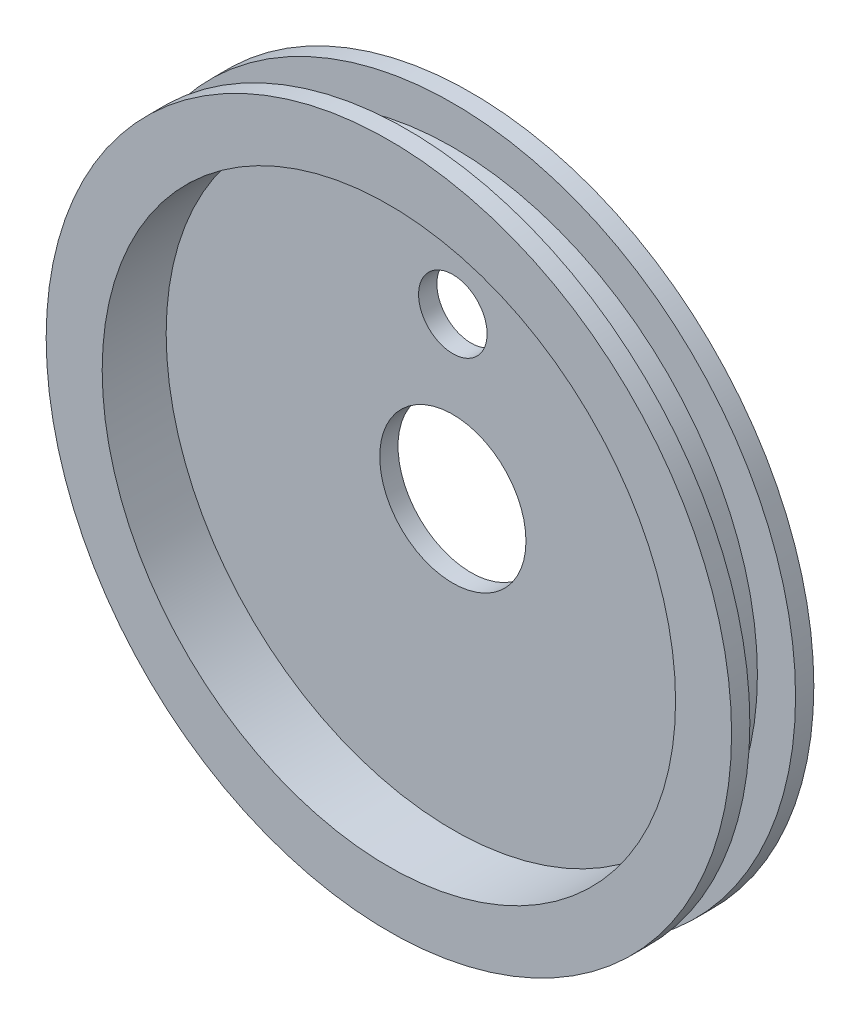
ISO-10303-21;
HEADER;
FILE_DESCRIPTION(('STEP AP214'),'2;1');
FILE_NAME('part.step','',(''),(''),'','','');
FILE_SCHEMA(('AUTOMOTIVE_DESIGN { 1 0 10303 214 1 1 1 1 }'));
ENDSEC;
DATA;
#1=APPLICATION_CONTEXT('core data for automotive mechanical design processes');
#2=APPLICATION_PROTOCOL_DEFINITION('international standard','automotive_design',2000,#1);
#3=PRODUCT_CONTEXT('',#1,'mechanical');
#4=PRODUCT('Part','Part','',(#3));
#5=PRODUCT_RELATED_PRODUCT_CATEGORY('part','',(#4));
#6=PRODUCT_DEFINITION_FORMATION('','',#4);
#7=PRODUCT_DEFINITION_CONTEXT('part definition',#1,'design');
#8=PRODUCT_DEFINITION('design','',#6,#7);
#9=PRODUCT_DEFINITION_SHAPE('','',#8);
#10=(LENGTH_UNIT() NAMED_UNIT(*) SI_UNIT(.MILLI.,.METRE.));
#11=(NAMED_UNIT(*) PLANE_ANGLE_UNIT() SI_UNIT($,.RADIAN.));
#12=(NAMED_UNIT(*) SI_UNIT($,.STERADIAN.) SOLID_ANGLE_UNIT());
#13=UNCERTAINTY_MEASURE_WITH_UNIT(LENGTH_MEASURE(1.E-05),#10,'distance_accuracy_value','');
#14=(GEOMETRIC_REPRESENTATION_CONTEXT(3) GLOBAL_UNCERTAINTY_ASSIGNED_CONTEXT((#13)) GLOBAL_UNIT_ASSIGNED_CONTEXT((#10,
#11,#12)) REPRESENTATION_CONTEXT('',''));
#15=CARTESIAN_POINT('',(0.,0.,0.));
#16=DIRECTION('',(0.,0.,1.));
#17=DIRECTION('',(1.,0.,0.));
#18=AXIS2_PLACEMENT_3D('',#15,#16,#17);
#19=CARTESIAN_POINT('',(0.,47.625,-2.54));
#20=DIRECTION('',(0.,0.,1.));
#21=DIRECTION('',(1.,0.,0.));
#22=AXIS2_PLACEMENT_3D('',#19,#20,#21);
#23=PLANE('',#22);
#24=CARTESIAN_POINT('',(0.,0.,-2.54));
#25=DIRECTION('',(0.,0.,1.));
#26=DIRECTION('',(1.,0.,0.));
#27=AXIS2_PLACEMENT_3D('',#24,#25,#26);
#28=CIRCLE('',#27,10.16);
#29=CARTESIAN_POINT('',(10.16,0.,-2.54));
#30=VERTEX_POINT('',#29);
#31=EDGE_CURVE('E73',#30,#30,#28,.T.);
#32=ORIENTED_EDGE('',*,*,#31,.T.);
#33=EDGE_LOOP('',(#32));
#34=FACE_BOUND('',#33,.T.);
#35=CARTESIAN_POINT('',(0.,22.225,-2.54));
#36=DIRECTION('',(0.,0.,1.));
#37=DIRECTION('',(1.,0.,0.));
#38=AXIS2_PLACEMENT_3D('',#35,#36,#37);
#39=CIRCLE('',#38,4.7625);
#40=CARTESIAN_POINT('',(-0.853024004277097,26.9104835714286,-2.54));
#41=VERTEX_POINT('',#40);
#42=CARTESIAN_POINT('',(0.853024004277097,26.9104835714286,-2.54));
#43=VERTEX_POINT('',#42);
#44=EDGE_CURVE('E67',#41,#43,#39,.T.);
#45=ORIENTED_EDGE('',*,*,#44,.T.);
#46=CARTESIAN_POINT('',(0.,0.,-2.54));
#47=DIRECTION('',(0.,0.,-1.));
#48=DIRECTION('',(-1.,0.,0.));
#49=AXIS2_PLACEMENT_3D('',#46,#47,#48);
#50=CIRCLE('',#49,26.924);
#51=EDGE_CURVE('E46',#43,#41,#50,.T.);
#52=ORIENTED_EDGE('',*,*,#51,.T.);
#53=EDGE_LOOP('',(#45,#52));
#54=FACE_BOUND('',#53,.T.);
#55=ADVANCED_FACE('F33',(#34,#54),#23,.F.);
#56=CARTESIAN_POINT('',(0.,0.,0.));
#57=DIRECTION('',(0.,0.,1.));
#58=DIRECTION('',(1.,0.,0.));
#59=AXIS2_PLACEMENT_3D('',#56,#57,#58);
#60=CYLINDRICAL_SURFACE('',#59,39.8398051528074);
#61=CARTESIAN_POINT('',(0.,0.,0.));
#62=DIRECTION('',(0.,0.,1.));
#63=DIRECTION('',(1.,0.,0.));
#64=AXIS2_PLACEMENT_3D('',#61,#62,#63);
#65=CIRCLE('',#64,39.8398051528074);
#66=CARTESIAN_POINT('',(39.8398051528074,0.,0.));
#67=VERTEX_POINT('',#66);
#68=EDGE_CURVE('E84',#67,#67,#65,.T.);
#69=ORIENTED_EDGE('',*,*,#68,.F.);
#70=EDGE_LOOP('',(#69));
#71=FACE_BOUND('',#70,.T.);
#72=CARTESIAN_POINT('',(0.,0.,8.89));
#73=DIRECTION('',(0.,0.,1.));
#74=DIRECTION('',(1.,0.,0.));
#75=AXIS2_PLACEMENT_3D('',#72,#73,#74);
#76=CIRCLE('',#75,39.8398051528074);
#77=CARTESIAN_POINT('',(39.8398051528074,0.,8.89));
#78=VERTEX_POINT('',#77);
#79=EDGE_CURVE('E81',#78,#78,#76,.T.);
#80=ORIENTED_EDGE('',*,*,#79,.T.);
#81=EDGE_LOOP('',(#80));
#82=FACE_BOUND('',#81,.T.);
#83=CARTESIAN_POINT('',(0.,39.8398051528074,2.98141861498659));
#84=CARTESIAN_POINT('',(0.0499288520424898,39.8398050189471,2.98142082707529));
#85=CARTESIAN_POINT('',(0.0998937489956119,39.8397102862242,2.98563895800753));
#86=CARTESIAN_POINT('',(0.198447026245543,39.8393414855794,3.00240712871577));
#87=CARTESIAN_POINT('',(0.247033683787857,39.8390672027133,3.01496715506395));
#88=CARTESIAN_POINT('',(0.341388460274037,39.838370368002,3.04806097311859));
#89=CARTESIAN_POINT('',(0.387157931086581,39.8379478879338,3.06859090523784));
#90=CARTESIAN_POINT('',(0.474587903429547,39.8370023321323,3.11703633356333));
#91=CARTESIAN_POINT('',(0.516249412892733,39.8364792811686,3.14495001186642));
#92=CARTESIAN_POINT('',(0.594306950466275,39.8353913070132,3.20738134347018));
#93=CARTESIAN_POINT('',(0.630701606195339,39.8348263729659,3.24190071259017));
#94=CARTESIAN_POINT('',(0.697180909828324,39.8337184015034,3.31656093253445));
#95=CARTESIAN_POINT('',(0.727265308001243,39.8331753649555,3.35670200573516));
#96=CARTESIAN_POINT('',(0.780270867007228,39.8321723913691,3.44146949289096));
#97=CARTESIAN_POINT('',(0.803191413596461,39.8317124614578,3.4860962910283));
#98=CARTESIAN_POINT('',(0.841214553407833,39.8309276371052,3.57856565421414));
#99=CARTESIAN_POINT('',(0.85631717099588,39.830602742243,3.62640820923966));
#100=CARTESIAN_POINT('',(0.87827336917194,39.8301246842132,3.72394258303009));
#101=CARTESIAN_POINT('',(0.885128326067495,39.8299714923932,3.77363409182833));
#102=CARTESIAN_POINT('',(0.890398847535254,39.8298540265871,3.87346277438261));
#103=CARTESIAN_POINT('',(0.888814437537807,39.8298897520317,3.92359994679525));
#104=CARTESIAN_POINT('',(0.877252387129153,39.8301460653447,4.02288740082374));
#105=CARTESIAN_POINT('',(0.867276240196033,39.8303666203189,4.07203785645211));
#106=CARTESIAN_POINT('',(0.83921620831718,39.8309676766993,4.16796620251455));
#107=CARTESIAN_POINT('',(0.821132309668231,39.8313481783758,4.21474408893849));
#108=CARTESIAN_POINT('',(0.777368400321464,39.8322262702664,4.30460420722662));
#109=CARTESIAN_POINT('',(0.75168770458807,39.8327238710389,4.34768610535565));
#110=CARTESIAN_POINT('',(0.693459705980447,39.8337800526231,4.42892762643978));
#111=CARTESIAN_POINT('',(0.6609123956652,39.8343386335008,4.46708724406077));
#112=CARTESIAN_POINT('',(0.589866611361192,39.8354539501939,4.53740970106475));
#113=CARTESIAN_POINT('',(0.551366840483524,39.8360106855802,4.56957123024065));
#114=CARTESIAN_POINT('',(0.469513592431183,39.8370594297202,4.62697446700608));
#115=CARTESIAN_POINT('',(0.426160114544587,39.8375514384645,4.65221617358064));
#116=CARTESIAN_POINT('',(0.33582939915632,39.8384152669079,4.69506308180457));
#117=CARTESIAN_POINT('',(0.288852142714982,39.8387870859789,4.71266824353838));
#118=CARTESIAN_POINT('',(0.1926077251012,39.8393686083555,4.73974147852577));
#119=CARTESIAN_POINT('',(0.143340567423051,39.8395783119087,4.74920956419576));
#120=CARTESIAN_POINT('',(0.0439262635908171,39.8398119316732,4.75973827716946));
#121=CARTESIAN_POINT('',(-0.00622069050895823,39.8398358879387,4.76080071704185));
#122=CARTESIAN_POINT('',(-0.10598107670898,39.8396954185272,4.75449270101634));
#123=CARTESIAN_POINT('',(-0.155594509140325,39.8395309929672,4.74712225035212));
#124=CARTESIAN_POINT('',(-0.252874442664679,39.8390323196941,4.72415917561094));
#125=CARTESIAN_POINT('',(-0.300541137808491,39.8386980889521,4.70856737320434));
#126=CARTESIAN_POINT('',(-0.392580446704433,39.8378974766485,4.66960502987248));
#127=CARTESIAN_POINT('',(-0.436953056980487,39.8374310949475,4.64623448073886));
#128=CARTESIAN_POINT('',(-0.521152952961519,39.836418638383,4.59237338380643));
#129=CARTESIAN_POINT('',(-0.560979457657947,39.8358725498627,4.56188161533409));
#130=CARTESIAN_POINT('',(-0.634948765826682,39.8347622796692,4.49464542773066));
#131=CARTESIAN_POINT('',(-0.669091560245824,39.8341980979671,4.45790099864037));
#132=CARTESIAN_POINT('',(-0.73073028314084,39.8331151318793,4.37919478060514));
#133=CARTESIAN_POINT('',(-0.758225041947966,39.8325963554925,4.33723207551008));
#134=CARTESIAN_POINT('',(-0.805779201329419,39.8316628150072,4.24928519266334));
#135=CARTESIAN_POINT('',(-0.82583861468679,39.83124805073,4.20330102182563));
#136=CARTESIAN_POINT('',(-0.857950628251854,39.8305693540948,4.10862095263577));
#137=CARTESIAN_POINT('',(-0.870003988785013,39.8303054074142,4.05992531226489));
#138=CARTESIAN_POINT('',(-0.885764242835529,39.8299580642524,3.96120090577609));
#139=CARTESIAN_POINT('',(-0.889471133686009,39.8298746678289,3.91117213923221));
#140=CARTESIAN_POINT('',(-0.8884331201314,39.8298978332203,3.81121341398135));
#141=CARTESIAN_POINT('',(-0.883690066495685,39.8300043534383,3.76128343603485));
#142=CARTESIAN_POINT('',(-0.865890593814175,39.8303952562232,3.6629286005792));
#143=CARTESIAN_POINT('',(-0.852834158171777,39.8306796391452,3.61450374607504));
#144=CARTESIAN_POINT('',(-0.81877866299651,39.8313942042507,3.52053271127797));
#145=CARTESIAN_POINT('',(-0.797779461625233,39.831824389038,3.47498658240904));
#146=CARTESIAN_POINT('',(-0.74843556664385,39.8327820403258,3.38806759557407));
#147=CARTESIAN_POINT('',(-0.720091148837359,39.8333095031734,3.34669458099388));
#148=CARTESIAN_POINT('',(-0.656857504723889,39.8344023433423,3.26928870045195));
#149=CARTESIAN_POINT('',(-0.621967541689803,39.8349677249268,3.23325643643091));
#150=CARTESIAN_POINT('',(-0.546623418074129,39.8360727704873,3.16755125330458));
#151=CARTESIAN_POINT('',(-0.506167879558315,39.8366124280498,3.1378799137159));
#152=CARTESIAN_POINT('',(-0.420829104914401,39.837605328039,3.08573597680793));
#153=CARTESIAN_POINT('',(-0.375943350858958,39.8380585208891,3.06326750443527));
#154=CARTESIAN_POINT('',(-0.283070622217011,39.8388264524819,3.02621131703086));
#155=CARTESIAN_POINT('',(-0.235087431837899,39.8391413566361,3.01161418206143));
#156=CARTESIAN_POINT('',(-0.155666606205625,39.8395128473673,2.99459327678612));
#157=CARTESIAN_POINT('',(-0.124744727626768,39.8396219878217,2.98965897243386));
#158=CARTESIAN_POINT('',(-0.062553282889765,39.8397681824721,2.98307094878893));
#159=CARTESIAN_POINT('',(-0.0312837167876895,39.8398052366796,2.98141722896722));
#160=CARTESIAN_POINT('',(0.,39.8398051528074,2.98141861498659));
#161=B_SPLINE_CURVE_WITH_KNOTS('',3,(#83,#84,#85,#86,#87,#88,#89,#90,#91,#92,#93,#94,#95,#96,
#97,#98,#99,#100,#101,#102,#103,#104,#105,#106,#107,#108,#109,#110,#111,#112,#113,#114,#115,
#116,#117,#118,#119,#120,#121,#122,#123,#124,#125,#126,#127,#128,#129,#130,#131,#132,#133,#134,
#135,#136,#137,#138,#139,#140,#141,#142,#143,#144,#145,#146,#147,#148,#149,#150,#151,#152,#153,
#154,#155,#156,#157,#158,#159,#160),.UNSPECIFIED.,.T.,.F.,(4,2,2,2,2,2,2,2,2,2,2,2,2,2,2,2,2,2,
2,2,2,2,2,2,2,2,2,2,2,2,2,2,2,2,2,2,2,2,4),(0.,0.149672368356552,0.29952424203869,
0.44930363728063,0.5990461905993,0.748827692270692,0.898615120487832,1.04841538827584,
1.19821518918299,1.34798998915824,1.49776433781724,1.64751203676172,1.79725998880136,
1.94702144837058,2.0967830702299,2.24657736741667,2.39637168657477,2.54616678868548,
2.69596166222266,2.84572423355444,2.99548671193976,3.14523422538055,3.29498189683977,
3.44475525594444,3.59452885360979,3.74432878359936,3.89412845604767,4.04391390016161,
4.19369939213523,4.34345208101524,4.49320506885827,4.64296073105041,4.79271077092086,
4.94247767587612,5.09228172731978,5.24217141610306,5.39188132566982,5.48566094499122,
5.57944054918929),.UNSPECIFIED.);
#162=CARTESIAN_POINT('',(0.,39.8398051528074,2.98141861498659));
#163=VERTEX_POINT('',#162);
#164=EDGE_CURVE('E103',#163,#163,#161,.T.);
#165=ORIENTED_EDGE('',*,*,#164,.F.);
#166=EDGE_LOOP('',(#165));
#167=FACE_BOUND('',#166,.T.);
#168=ADVANCED_FACE('F109',(#71,#82,#167),#60,.F.);
#169=CARTESIAN_POINT('',(0.,0.,0.));
#170=DIRECTION('',(0.,0.,1.));
#171=DIRECTION('',(1.,0.,0.));
#172=AXIS2_PLACEMENT_3D('',#169,#170,#171);
#173=CYLINDRICAL_SURFACE('',#172,42.32529);
#174=CARTESIAN_POINT('',(0.,0.,6.35));
#175=DIRECTION('',(0.,0.,1.));
#176=DIRECTION('',(1.,0.,0.));
#177=AXIS2_PLACEMENT_3D('',#174,#175,#176);
#178=CIRCLE('',#177,42.32529);
#179=CARTESIAN_POINT('',(42.32529,0.,6.35));
#180=VERTEX_POINT('',#179);
#181=EDGE_CURVE('E96',#180,#180,#178,.T.);
#182=ORIENTED_EDGE('',*,*,#181,.F.);
#183=EDGE_LOOP('',(#182));
#184=FACE_BOUND('',#183,.T.);
#185=CARTESIAN_POINT('',(0.,0.,0.));
#186=DIRECTION('',(0.,0.,1.));
#187=DIRECTION('',(1.,0.,0.));
#188=AXIS2_PLACEMENT_3D('',#185,#186,#187);
#189=CIRCLE('',#188,42.32529);
#190=CARTESIAN_POINT('',(42.32529,0.,0.));
#191=VERTEX_POINT('',#190);
#192=EDGE_CURVE('E93',#191,#191,#189,.T.);
#193=ORIENTED_EDGE('',*,*,#192,.T.);
#194=EDGE_LOOP('',(#193));
#195=FACE_BOUND('',#194,.T.);
#196=CARTESIAN_POINT('',(0.,42.32529,2.98141861498659));
#197=CARTESIAN_POINT('',(-0.0499296120777934,42.3252898739703,2.98142082733742));
#198=CARTESIAN_POINT('',(-0.0998952876539651,42.3252007015313,2.98563908618748));
#199=CARTESIAN_POINT('',(-0.198450152827213,42.3248535474286,3.00240779460558));
#200=CARTESIAN_POINT('',(-0.247037618841143,42.3245953633392,3.01496823589063));
#201=CARTESIAN_POINT('',(-0.341394016352993,42.3239394293395,3.04806322094483));
#202=CARTESIAN_POINT('',(-0.387164297702076,42.3235417468913,3.06859391077084));
#203=CARTESIAN_POINT('',(-0.474595730402443,42.3226516937417,3.1170411928185));
#204=CARTESIAN_POINT('',(-0.516257890896018,42.3221593463824,3.1449559649362));
#205=CARTESIAN_POINT('',(-0.594315745583253,42.3211352523972,3.2073892059897));
#206=CARTESIAN_POINT('',(-0.630710160805565,42.3206034962504,3.24190927393656));
#207=CARTESIAN_POINT('',(-0.697188808874741,42.3195606025159,3.31657084994335));
#208=CARTESIAN_POINT('',(-0.727272792204875,42.3190494657441,3.3567125801812));
#209=CARTESIAN_POINT('',(-0.780277018347561,42.318105424443,3.44148072512352));
#210=CARTESIAN_POINT('',(-0.803196732227812,42.317672525691,3.48610747063181));
#211=CARTESIAN_POINT('',(-0.841218270171466,42.3169338338777,3.57857644840945));
#212=CARTESIAN_POINT('',(-0.85632011761405,42.3166280404363,3.62641867106248));
#213=CARTESIAN_POINT('',(-0.878275141928297,42.3161780906474,3.72395308588133));
#214=CARTESIAN_POINT('',(-0.885129536462519,42.3160339104393,3.77364500383906));
#215=CARTESIAN_POINT('',(-0.890398825893437,42.3159233715167,3.87347438114387));
#216=CARTESIAN_POINT('',(-0.888813745055074,42.3159570122909,3.92361183920952));
#217=CARTESIAN_POINT('',(-0.877250133498243,42.3161982994669,4.02290080720812));
#218=CARTESIAN_POINT('',(-0.867272925576054,42.3164059184457,4.07205247127533));
#219=CARTESIAN_POINT('',(-0.83921031790074,42.3169717128389,4.16798305570311));
#220=CARTESIAN_POINT('',(-0.821124905029469,42.3173298884968,4.21476197222472));
#221=CARTESIAN_POINT('',(-0.777357753094501,42.3181564486638,4.30462338836936));
#222=CARTESIAN_POINT('',(-0.751675407276978,42.3186248419752,4.34770559238769));
#223=CARTESIAN_POINT('',(-0.693443884794253,42.3196190231392,4.42894737008021));
#224=CARTESIAN_POINT('',(-0.660894701852571,42.3201448110443,4.46710693925493));
#225=CARTESIAN_POINT('',(-0.589845966847594,42.3211946284692,4.53742795224619));
#226=CARTESIAN_POINT('',(-0.551345265688443,42.3217186576295,4.56958823509223));
#227=CARTESIAN_POINT('',(-0.469490457905188,42.3227057822773,4.62698881553404));
#228=CARTESIAN_POINT('',(-0.426136350578899,42.3231688777559,4.65222911212863));
#229=CARTESIAN_POINT('',(-0.335804779951831,42.3239819310574,4.69507309212989));
#230=CARTESIAN_POINT('',(-0.288827299955405,42.3243318883588,4.71267674034622));
#231=CARTESIAN_POINT('',(-0.192582809477149,42.3248792044991,4.73974697781159));
#232=CARTESIAN_POINT('',(-0.143315802102439,42.325076563545,4.74921357810308));
#233=CARTESIAN_POINT('',(-0.0439008732974561,42.3252964081861,4.75973957469376));
#234=CARTESIAN_POINT('',(0.00624687801857583,42.3253189271871,4.76080057700588));
#235=CARTESIAN_POINT('',(0.106008620796154,42.32518664153,4.75448944269879));
#236=CARTESIAN_POINT('',(0.155622612548418,42.3250318369686,4.747117310673));
#237=CARTESIAN_POINT('',(0.252903985208035,42.3245623756152,4.72415050702803));
#238=CARTESIAN_POINT('',(0.300571538025351,42.3242477329732,4.70855656326105));
#239=CARTESIAN_POINT('',(0.392612176578595,42.3234940601472,4.66958953733121));
#240=CARTESIAN_POINT('',(0.436985259282332,42.3230550298486,4.64621644800863));
#241=CARTESIAN_POINT('',(0.52118474880612,42.3221019761661,4.59235047575363));
#242=CARTESIAN_POINT('',(0.561010463538259,42.3215879413938,4.56185651120252));
#243=CARTESIAN_POINT('',(0.634977755365647,42.3205428595163,4.49461599506995));
#244=CARTESIAN_POINT('',(0.669119324178201,42.3200118123863,4.45786943437762));
#245=CARTESIAN_POINT('',(0.73075450252613,42.3189924800004,4.37915996367885));
#246=CARTESIAN_POINT('',(0.758247075560659,42.318504201419,4.33719624191965));
#247=CARTESIAN_POINT('',(0.805796739998628,42.3176255617166,4.24924783701514));
#248=CARTESIAN_POINT('',(0.825853843624142,42.3172352004346,4.20326316047944));
#249=CARTESIAN_POINT('',(0.857961414631366,42.3165964540058,4.1085821045371));
#250=CARTESIAN_POINT('',(0.870012556291809,42.3163480569026,4.05988595387093));
#251=CARTESIAN_POINT('',(0.885768330869535,42.3160212105151,3.96116097664618));
#252=CARTESIAN_POINT('',(0.889472959707888,42.3159427613137,3.91113214943633));
#253=CARTESIAN_POINT('',(0.888430451921636,42.3159646601508,3.81117243344274));
#254=CARTESIAN_POINT('',(0.883684956815074,42.3160649734629,3.7612415275231));
#255=CARTESIAN_POINT('',(0.865880268377808,42.3164330155629,3.66288523089004));
#256=CARTESIAN_POINT('',(0.852821058434744,42.3167007446852,3.61445984318513));
#257=CARTESIAN_POINT('',(0.818759713336494,42.3173734338617,3.5204881861531));
#258=CARTESIAN_POINT('',(0.7977574353478,42.3177783963836,3.47494196861686));
#259=CARTESIAN_POINT('',(0.748407157592086,42.3186798789506,3.3880233734676));
#260=CARTESIAN_POINT('',(0.720059435074458,42.31917639554,3.34665083840331));
#261=CARTESIAN_POINT('',(0.656819877990526,42.3202050866824,3.26924756776812));
#262=CARTESIAN_POINT('',(0.621927468687045,42.3207372643644,3.23321730183917));
#263=CARTESIAN_POINT('',(0.546578817932324,42.3217773922375,3.16751655224001));
#264=CARTESIAN_POINT('',(0.50612119831044,42.3222853363853,3.13784764857096));
#265=CARTESIAN_POINT('',(0.42077924015169,42.3232198597729,3.08570925818333));
#266=CARTESIAN_POINT('',(0.375892431442407,42.3236463932163,3.06324381887603));
#267=CARTESIAN_POINT('',(0.283018275295015,42.3243691242123,3.02619379543535));
#268=CARTESIAN_POINT('',(0.235034712539334,42.3246654775294,3.01159978809233));
#269=CARTESIAN_POINT('',(0.155622219190976,42.3250150169904,2.99458570932139));
#270=CARTESIAN_POINT('',(0.124709026194083,42.3251176898312,2.98965423601651));
#271=CARTESIAN_POINT('',(0.0625352718989247,42.3252552208021,2.98306999620126));
#272=CARTESIAN_POINT('',(0.0312747106502187,42.325290078942,2.98141722922314));
#273=CARTESIAN_POINT('',(0.,42.32529,2.98141861498659));
#274=B_SPLINE_CURVE_WITH_KNOTS('',3,(#196,#197,#198,#199,#200,#201,#202,#203,#204,#205,#206,
#207,#208,#209,#210,#211,#212,#213,#214,#215,#216,#217,#218,#219,#220,#221,#222,#223,#224,#225,
#226,#227,#228,#229,#230,#231,#232,#233,#234,#235,#236,#237,#238,#239,#240,#241,#242,#243,#244,
#245,#246,#247,#248,#249,#250,#251,#252,#253,#254,#255,#256,#257,#258,#259,#260,#261,#262,#263,
#264,#265,#266,#267,#268,#269,#270,#271,#272,#273),.UNSPECIFIED.,.T.,.F.,(4,2,2,2,2,2,2,2,2,2,2,
2,2,2,2,2,2,2,2,2,2,2,2,2,2,2,2,2,2,2,2,2,2,2,2,2,2,2,4),(0.,0.149674681597537,
0.299528957749319,0.449310863265737,0.599055883357092,0.748837199713561,0.898624437360846,
1.0484227310699,1.19822057680743,1.3479963035198,1.49777159960145,1.64752329200271,
1.79727522668593,1.94703912502667,2.09680316025638,2.2465961475401,2.39638915649574,
2.54618285570344,2.69597635163183,2.84574122662262,2.99550602003828,3.1452575574541,
3.29500923269768,3.44478366914444,3.59455832383422,3.74435631161688,3.89415405316758,
4.04393917684158,4.19372437371535,4.34348047654481,4.49323687861597,4.64299597375854,
4.79274941715719,4.94251601767169,5.09231977343394,5.24220755255345,5.39191549441878,
5.48566813602072,5.5794207642473),.UNSPECIFIED.);
#275=CARTESIAN_POINT('',(0.,42.32529,2.98141861498659));
#276=VERTEX_POINT('',#275);
#277=EDGE_CURVE('E37',#276,#276,#274,.T.);
#278=ORIENTED_EDGE('',*,*,#277,.F.);
#279=EDGE_LOOP('',(#278));
#280=FACE_BOUND('',#279,.T.);
#281=ADVANCED_FACE('F129',(#184,#195,#280),#173,.T.);
#282=CARTESIAN_POINT('',(0.,42.32529,6.35));
#283=DIRECTION('',(0.,0.,1.));
#284=DIRECTION('',(1.,0.,0.));
#285=AXIS2_PLACEMENT_3D('',#282,#283,#284);
#286=PLANE('',#285);
#287=CARTESIAN_POINT('',(0.,0.,6.35));
#288=DIRECTION('',(0.,0.,1.));
#289=DIRECTION('',(1.,0.,0.));
#290=AXIS2_PLACEMENT_3D('',#287,#288,#289);
#291=CIRCLE('',#290,47.625);
#292=CARTESIAN_POINT('',(47.625,0.,6.35));
#293=VERTEX_POINT('',#292);
#294=EDGE_CURVE('E60',#293,#293,#291,.T.);
#295=ORIENTED_EDGE('',*,*,#294,.F.);
#296=EDGE_LOOP('',(#295));
#297=FACE_BOUND('',#296,.T.);
#298=ORIENTED_EDGE('',*,*,#181,.T.);
#299=EDGE_LOOP('',(#298));
#300=FACE_BOUND('',#299,.T.);
#301=ADVANCED_FACE('F35',(#297,#300),#286,.F.);
#302=CARTESIAN_POINT('',(0.,0.,0.));
#303=DIRECTION('',(0.,0.,1.));
#304=DIRECTION('',(1.,0.,0.));
#305=AXIS2_PLACEMENT_3D('',#302,#303,#304);
#306=CYLINDRICAL_SURFACE('',#305,47.625);
#307=CARTESIAN_POINT('',(0.,0.,8.89));
#308=DIRECTION('',(0.,0.,1.));
#309=DIRECTION('',(1.,0.,0.));
#310=AXIS2_PLACEMENT_3D('',#307,#308,#309);
#311=CIRCLE('',#310,47.625);
#312=CARTESIAN_POINT('',(47.625,0.,8.89));
#313=VERTEX_POINT('',#312);
#314=EDGE_CURVE('E78',#313,#313,#311,.T.);
#315=ORIENTED_EDGE('',*,*,#314,.F.);
#316=EDGE_LOOP('',(#315));
#317=FACE_BOUND('',#316,.T.);
#318=ORIENTED_EDGE('',*,*,#294,.T.);
#319=EDGE_LOOP('',(#318));
#320=FACE_BOUND('',#319,.T.);
#321=ADVANCED_FACE('F151',(#317,#320),#306,.T.);
#322=CARTESIAN_POINT('',(0.,47.625,8.89));
#323=DIRECTION('',(0.,0.,-1.));
#324=DIRECTION('',(-1.,0.,0.));
#325=AXIS2_PLACEMENT_3D('',#322,#323,#324);
#326=PLANE('',#325);
#327=ORIENTED_EDGE('',*,*,#79,.F.);
#328=EDGE_LOOP('',(#327));
#329=FACE_BOUND('',#328,.T.);
#330=ORIENTED_EDGE('',*,*,#314,.T.);
#331=EDGE_LOOP('',(#330));
#332=FACE_BOUND('',#331,.T.);
#333=ADVANCED_FACE('F146',(#329,#332),#326,.F.);
#334=CARTESIAN_POINT('',(0.,0.,0.));
#335=DIRECTION('',(0.,0.,-1.));
#336=DIRECTION('',(-1.,0.,0.));
#337=AXIS2_PLACEMENT_3D('',#334,#335,#336);
#338=PLANE('',#337);
#339=CARTESIAN_POINT('',(0.,22.225,0.));
#340=DIRECTION('',(0.,0.,1.));
#341=DIRECTION('',(1.,0.,0.));
#342=AXIS2_PLACEMENT_3D('',#339,#340,#341);
#343=CIRCLE('',#342,4.7625);
#344=CARTESIAN_POINT('',(4.7625,22.225,0.));
#345=VERTEX_POINT('',#344);
#346=EDGE_CURVE('E69',#345,#345,#343,.T.);
#347=ORIENTED_EDGE('',*,*,#346,.F.);
#348=EDGE_LOOP('',(#347));
#349=FACE_BOUND('',#348,.T.);
#350=CARTESIAN_POINT('',(0.,0.,0.));
#351=DIRECTION('',(0.,0.,1.));
#352=DIRECTION('',(1.,0.,0.));
#353=AXIS2_PLACEMENT_3D('',#350,#351,#352);
#354=CIRCLE('',#353,10.16);
#355=CARTESIAN_POINT('',(10.16,0.,0.));
#356=VERTEX_POINT('',#355);
#357=EDGE_CURVE('E71',#356,#356,#354,.T.);
#358=ORIENTED_EDGE('',*,*,#357,.F.);
#359=EDGE_LOOP('',(#358));
#360=FACE_BOUND('',#359,.T.);
#361=ORIENTED_EDGE('',*,*,#68,.T.);
#362=EDGE_LOOP('',(#361));
#363=FACE_BOUND('',#362,.T.);
#364=ADVANCED_FACE('F143',(#349,#360,#363),#338,.F.);
#365=CARTESIAN_POINT('',(0.,0.,-2.54));
#366=DIRECTION('',(0.,0.,-1.));
#367=DIRECTION('',(-1.,0.,0.));
#368=AXIS2_PLACEMENT_3D('',#365,#366,#367);
#369=CIRCLE('',#368,28.194);
#370=CARTESIAN_POINT('',(-28.194,0.,-2.54));
#371=VERTEX_POINT('',#370);
#372=EDGE_CURVE('E11',#371,#371,#369,.T.);
#373=ORIENTED_EDGE('',*,*,#372,.F.);
#374=EDGE_LOOP('',(#373));
#375=FACE_BOUND('',#374,.T.);
#376=CARTESIAN_POINT('',(0.,0.,-2.54));
#377=DIRECTION('',(0.,0.,1.));
#378=DIRECTION('',(1.,0.,0.));
#379=AXIS2_PLACEMENT_3D('',#376,#377,#378);
#380=CIRCLE('',#379,47.625);
#381=CARTESIAN_POINT('',(47.625,0.,-2.54));
#382=VERTEX_POINT('',#381);
#383=EDGE_CURVE('E87',#382,#382,#380,.T.);
#384=ORIENTED_EDGE('',*,*,#383,.F.);
#385=EDGE_LOOP('',(#384));
#386=FACE_BOUND('',#385,.T.);
#387=ADVANCED_FACE('F140',(#375,#386),#23,.F.);
#388=CARTESIAN_POINT('',(0.,0.,0.));
#389=DIRECTION('',(0.,0.,1.));
#390=DIRECTION('',(1.,0.,0.));
#391=AXIS2_PLACEMENT_3D('',#388,#389,#390);
#392=CYLINDRICAL_SURFACE('',#391,47.625);
#393=CARTESIAN_POINT('',(0.,0.,0.));
#394=DIRECTION('',(0.,0.,1.));
#395=DIRECTION('',(1.,0.,0.));
#396=AXIS2_PLACEMENT_3D('',#393,#394,#395);
#397=CIRCLE('',#396,47.625);
#398=CARTESIAN_POINT('',(47.625,0.,0.));
#399=VERTEX_POINT('',#398);
#400=EDGE_CURVE('E90',#399,#399,#397,.T.);
#401=ORIENTED_EDGE('',*,*,#400,.F.);
#402=EDGE_LOOP('',(#401));
#403=FACE_BOUND('',#402,.T.);
#404=ORIENTED_EDGE('',*,*,#383,.T.);
#405=EDGE_LOOP('',(#404));
#406=FACE_BOUND('',#405,.T.);
#407=ADVANCED_FACE('F136',(#403,#406),#392,.T.);
#408=CARTESIAN_POINT('',(0.,42.32529,0.));
#409=DIRECTION('',(0.,0.,-1.));
#410=DIRECTION('',(-1.,0.,0.));
#411=AXIS2_PLACEMENT_3D('',#408,#409,#410);
#412=PLANE('',#411);
#413=ORIENTED_EDGE('',*,*,#192,.F.);
#414=EDGE_LOOP('',(#413));
#415=FACE_BOUND('',#414,.T.);
#416=ORIENTED_EDGE('',*,*,#400,.T.);
#417=EDGE_LOOP('',(#416));
#418=FACE_BOUND('',#417,.T.);
#419=ADVANCED_FACE('F127',(#415,#418),#412,.F.);
#420=CARTESIAN_POINT('',(0.,0.,-2.54));
#421=DIRECTION('',(0.,0.,1.));
#422=DIRECTION('',(1.,0.,0.));
#423=AXIS2_PLACEMENT_3D('',#420,#421,#422);
#424=CYLINDRICAL_SURFACE('',#423,10.16);
#425=ORIENTED_EDGE('',*,*,#31,.F.);
#426=EDGE_LOOP('',(#425));
#427=FACE_BOUND('',#426,.T.);
#428=ORIENTED_EDGE('',*,*,#357,.T.);
#429=EDGE_LOOP('',(#428));
#430=FACE_BOUND('',#429,.T.);
#431=ADVANCED_FACE('F124',(#427,#430),#424,.F.);
#432=CARTESIAN_POINT('',(0.,22.225,-6.35));
#433=DIRECTION('',(0.,0.,1.));
#434=DIRECTION('',(1.,0.,0.));
#435=AXIS2_PLACEMENT_3D('',#432,#433,#434);
#436=CYLINDRICAL_SURFACE('',#435,4.7625);
#437=ORIENTED_EDGE('',*,*,#346,.T.);
#438=EDGE_LOOP('',(#437));
#439=FACE_BOUND('',#438,.T.);
#440=EDGE_CURVE('E65',#43,#41,#39,.T.);
#441=ORIENTED_EDGE('',*,*,#440,.F.);
#442=ORIENTED_EDGE('',*,*,#44,.F.);
#443=EDGE_LOOP('',(#441,#442));
#444=FACE_BOUND('',#443,.T.);
#445=ADVANCED_FACE('F70',(#439,#444),#436,.F.);
#446=CARTESIAN_POINT('',(0.,55.372,3.87041861498659));
#447=DIRECTION('',(0.,-1.,0.));
#448=DIRECTION('',(0.,0.,-1.));
#449=AXIS2_PLACEMENT_3D('',#446,#447,#448);
#450=CYLINDRICAL_SURFACE('',#449,0.889);
#451=ORIENTED_EDGE('',*,*,#277,.T.);
#452=EDGE_LOOP('',(#451));
#453=FACE_BOUND('',#452,.T.);
#454=ORIENTED_EDGE('',*,*,#164,.T.);
#455=EDGE_LOOP('',(#454));
#456=FACE_BOUND('',#455,.T.);
#457=ADVANCED_FACE('F113',(#453,#456),#450,.F.);
#458=CARTESIAN_POINT('',(0.,0.,-2.54));
#459=DIRECTION('',(0.,0.,-1.));
#460=DIRECTION('',(-1.,0.,0.));
#461=AXIS2_PLACEMENT_3D('',#458,#459,#460);
#462=PLANE('',#461);
#463=EDGE_CURVE('E53',#41,#43,#50,.T.);
#464=ORIENTED_EDGE('',*,*,#463,.T.);
#465=ORIENTED_EDGE('',*,*,#440,.T.);
#466=EDGE_LOOP('',(#464,#465));
#467=FACE_BOUND('',#466,.T.);
#468=ADVANCED_FACE('F63',(#467),#462,.F.);
#469=CARTESIAN_POINT('',(0.,0.,-5.08));
#470=DIRECTION('',(0.,0.,-1.));
#471=DIRECTION('',(-1.,0.,0.));
#472=AXIS2_PLACEMENT_3D('',#469,#470,#471);
#473=PLANE('',#472);
#474=CARTESIAN_POINT('',(0.,0.,-5.08));
#475=DIRECTION('',(0.,0.,-1.));
#476=DIRECTION('',(-1.,0.,0.));
#477=AXIS2_PLACEMENT_3D('',#474,#475,#476);
#478=CIRCLE('',#477,28.194);
#479=CARTESIAN_POINT('',(-28.194,0.,-5.08));
#480=VERTEX_POINT('',#479);
#481=EDGE_CURVE('E186',#480,#480,#478,.T.);
#482=ORIENTED_EDGE('',*,*,#481,.T.);
#483=EDGE_LOOP('',(#482));
#484=FACE_BOUND('',#483,.T.);
#485=CARTESIAN_POINT('',(0.,0.,-5.08));
#486=DIRECTION('',(0.,0.,-1.));
#487=DIRECTION('',(-1.,0.,0.));
#488=AXIS2_PLACEMENT_3D('',#485,#486,#487);
#489=CIRCLE('',#488,26.924);
#490=CARTESIAN_POINT('',(-26.924,0.,-5.08));
#491=VERTEX_POINT('',#490);
#492=EDGE_CURVE('E66',#491,#491,#489,.T.);
#493=ORIENTED_EDGE('',*,*,#492,.F.);
#494=EDGE_LOOP('',(#493));
#495=FACE_BOUND('',#494,.T.);
#496=ADVANCED_FACE('F195',(#484,#495),#473,.T.);
#497=CARTESIAN_POINT('',(0.,0.,-5.08));
#498=DIRECTION('',(0.,0.,1.));
#499=DIRECTION('',(1.,0.,0.));
#500=AXIS2_PLACEMENT_3D('',#497,#498,#499);
#501=CYLINDRICAL_SURFACE('',#500,28.194);
#502=ORIENTED_EDGE('',*,*,#481,.F.);
#503=EDGE_LOOP('',(#502));
#504=FACE_BOUND('',#503,.T.);
#505=ORIENTED_EDGE('',*,*,#372,.T.);
#506=EDGE_LOOP('',(#505));
#507=FACE_BOUND('',#506,.T.);
#508=ADVANCED_FACE('F119',(#504,#507),#501,.T.);
#509=CARTESIAN_POINT('',(0.,0.,-5.08));
#510=DIRECTION('',(0.,0.,1.));
#511=DIRECTION('',(1.,0.,0.));
#512=AXIS2_PLACEMENT_3D('',#509,#510,#511);
#513=CYLINDRICAL_SURFACE('',#512,26.924);
#514=ORIENTED_EDGE('',*,*,#492,.T.);
#515=EDGE_LOOP('',(#514));
#516=FACE_BOUND('',#515,.T.);
#517=ORIENTED_EDGE('',*,*,#463,.F.);
#518=ORIENTED_EDGE('',*,*,#51,.F.);
#519=EDGE_LOOP('',(#517,#518));
#520=FACE_BOUND('',#519,.T.);
#521=ADVANCED_FACE('F56',(#516,#520),#513,.F.);
#522=CLOSED_SHELL('',(#55,#168,#281,#301,#321,#333,#364,#387,#407,#419,#431,#445,#457,#468,#496,
#508,#521));
#523=MANIFOLD_SOLID_BREP('B2',#522);
#524=ADVANCED_BREP_SHAPE_REPRESENTATION('',(#18,#523),#14);
#525=SHAPE_DEFINITION_REPRESENTATION(#9,#524);
ENDSEC;
END-ISO-10303-21;
